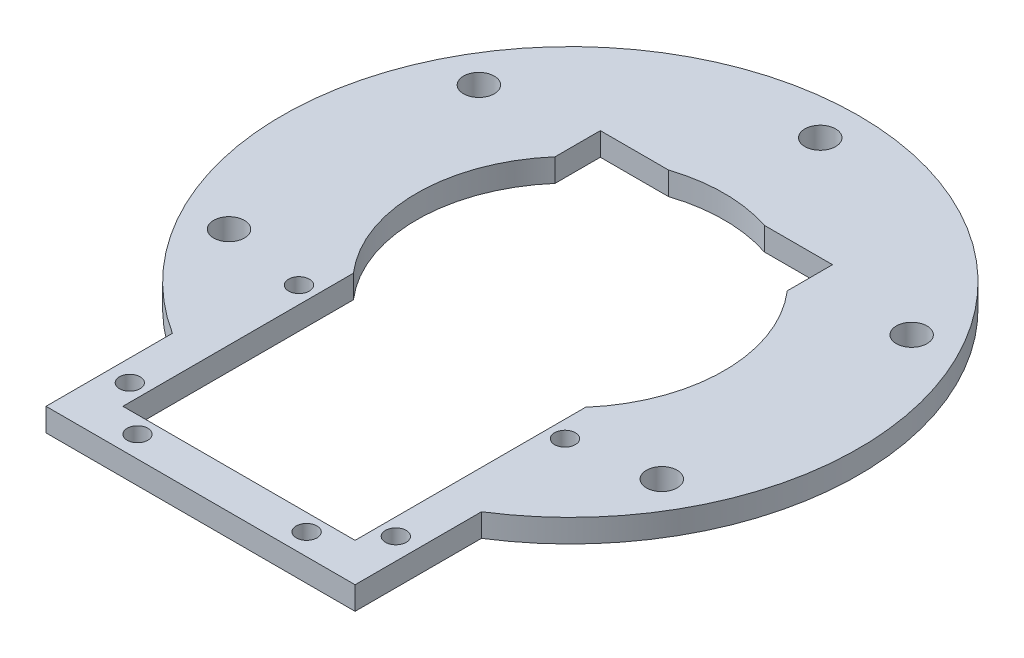
ISO-10303-21;
HEADER;
FILE_DESCRIPTION(('STEP AP214'),'2;1');
FILE_NAME('part.step','',(''),(''),'','','');
FILE_SCHEMA(('AUTOMOTIVE_DESIGN { 1 0 10303 214 1 1 1 1 }'));
ENDSEC;
DATA;
#1=APPLICATION_CONTEXT('core data for automotive mechanical design processes');
#2=APPLICATION_PROTOCOL_DEFINITION('international standard','automotive_design',2000,#1);
#3=PRODUCT_CONTEXT('',#1,'mechanical');
#4=PRODUCT('Part','Part','',(#3));
#5=PRODUCT_RELATED_PRODUCT_CATEGORY('part','',(#4));
#6=PRODUCT_DEFINITION_FORMATION('','',#4);
#7=PRODUCT_DEFINITION_CONTEXT('part definition',#1,'design');
#8=PRODUCT_DEFINITION('design','',#6,#7);
#9=PRODUCT_DEFINITION_SHAPE('','',#8);
#10=(LENGTH_UNIT() NAMED_UNIT(*) SI_UNIT(.MILLI.,.METRE.));
#11=(NAMED_UNIT(*) PLANE_ANGLE_UNIT() SI_UNIT($,.RADIAN.));
#12=(NAMED_UNIT(*) SI_UNIT($,.STERADIAN.) SOLID_ANGLE_UNIT());
#13=UNCERTAINTY_MEASURE_WITH_UNIT(LENGTH_MEASURE(1.E-05),#10,'distance_accuracy_value','');
#14=(GEOMETRIC_REPRESENTATION_CONTEXT(3) GLOBAL_UNCERTAINTY_ASSIGNED_CONTEXT((#13)) GLOBAL_UNIT_ASSIGNED_CONTEXT((#10,
#11,#12)) REPRESENTATION_CONTEXT('',''));
#15=CARTESIAN_POINT('',(0.,0.,0.));
#16=DIRECTION('',(0.,0.,1.));
#17=DIRECTION('',(1.,0.,0.));
#18=AXIS2_PLACEMENT_3D('',#15,#16,#17);
#19=CARTESIAN_POINT('',(15.1,0.,0.));
#20=DIRECTION('',(1.,0.,0.));
#21=DIRECTION('',(0.,0.,-1.));
#22=AXIS2_PLACEMENT_3D('',#19,#20,#21);
#23=PLANE('',#22);
#24=DIRECTION('',(0.,0.,-1.));
#25=VECTOR('',#24,1.);
#26=CARTESIAN_POINT('',(15.1,0.,0.));
#27=LINE('',#26,#25);
#28=CARTESIAN_POINT('',(15.1,0.,-13.1144957966366));
#29=VERTEX_POINT('',#28);
#30=CARTESIAN_POINT('',(15.1,0.,-19.));
#31=VERTEX_POINT('',#30);
#32=EDGE_CURVE('E296',#29,#31,#27,.T.);
#33=ORIENTED_EDGE('',*,*,#32,.F.);
#34=DIRECTION('',(0.,1.,0.));
#35=VECTOR('',#34,1.);
#36=CARTESIAN_POINT('',(15.1,0.,-13.1144957966366));
#37=LINE('',#36,#35);
#38=CARTESIAN_POINT('',(15.1,3.,-13.1144957966366));
#39=VERTEX_POINT('',#38);
#40=EDGE_CURVE('E158',#29,#39,#37,.T.);
#41=ORIENTED_EDGE('',*,*,#40,.T.);
#42=DIRECTION('',(0.,0.,-1.));
#43=VECTOR('',#42,1.);
#44=CARTESIAN_POINT('',(15.1,3.,0.));
#45=LINE('',#44,#43);
#46=CARTESIAN_POINT('',(15.1,3.,-19.));
#47=VERTEX_POINT('',#46);
#48=EDGE_CURVE('E169',#39,#47,#45,.T.);
#49=ORIENTED_EDGE('',*,*,#48,.T.);
#50=DIRECTION('',(0.,1.,0.));
#51=VECTOR('',#50,1.);
#52=CARTESIAN_POINT('',(15.1,0.,-19.));
#53=LINE('',#52,#51);
#54=EDGE_CURVE('E299',#31,#47,#53,.T.);
#55=ORIENTED_EDGE('',*,*,#54,.F.);
#56=EDGE_LOOP('',(#33,#41,#49,#55));
#57=FACE_BOUND('',#56,.T.);
#58=ADVANCED_FACE('F49',(#57),#23,.F.);
#59=CARTESIAN_POINT('',(-15.1,0.,0.));
#60=DIRECTION('',(-1.,0.,0.));
#61=DIRECTION('',(0.,0.,1.));
#62=AXIS2_PLACEMENT_3D('',#59,#60,#61);
#63=PLANE('',#62);
#64=DIRECTION('',(0.,0.,1.));
#65=VECTOR('',#64,1.);
#66=CARTESIAN_POINT('',(-15.1,0.,0.));
#67=LINE('',#66,#65);
#68=CARTESIAN_POINT('',(-15.1,0.,13.1144957966366));
#69=VERTEX_POINT('',#68);
#70=CARTESIAN_POINT('',(-15.1,0.,43.1));
#71=VERTEX_POINT('',#70);
#72=EDGE_CURVE('E340',#69,#71,#67,.T.);
#73=ORIENTED_EDGE('',*,*,#72,.F.);
#74=DIRECTION('',(0.,1.,0.));
#75=VECTOR('',#74,1.);
#76=CARTESIAN_POINT('',(-15.1,0.,13.1144957966366));
#77=LINE('',#76,#75);
#78=CARTESIAN_POINT('',(-15.1,3.,13.1144957966366));
#79=VERTEX_POINT('',#78);
#80=EDGE_CURVE('E159',#69,#79,#77,.T.);
#81=ORIENTED_EDGE('',*,*,#80,.T.);
#82=DIRECTION('',(0.,0.,1.));
#83=VECTOR('',#82,1.);
#84=CARTESIAN_POINT('',(-15.1,3.,0.));
#85=LINE('',#84,#83);
#86=CARTESIAN_POINT('',(-15.1,3.,43.1));
#87=VERTEX_POINT('',#86);
#88=EDGE_CURVE('E185',#79,#87,#85,.T.);
#89=ORIENTED_EDGE('',*,*,#88,.T.);
#90=DIRECTION('',(0.,1.,0.));
#91=VECTOR('',#90,1.);
#92=CARTESIAN_POINT('',(-15.1,0.,43.1));
#93=LINE('',#92,#91);
#94=EDGE_CURVE('E222',#71,#87,#93,.T.);
#95=ORIENTED_EDGE('',*,*,#94,.F.);
#96=EDGE_LOOP('',(#73,#81,#89,#95));
#97=FACE_BOUND('',#96,.T.);
#98=ADVANCED_FACE('F384',(#97),#63,.F.);
#99=CARTESIAN_POINT('',(0.,0.,-19.));
#100=DIRECTION('',(0.,0.,-1.));
#101=DIRECTION('',(-1.,0.,0.));
#102=AXIS2_PLACEMENT_3D('',#99,#100,#101);
#103=PLANE('',#102);
#104=DIRECTION('',(-1.,0.,0.));
#105=VECTOR('',#104,1.);
#106=CARTESIAN_POINT('',(0.,0.,-19.));
#107=LINE('',#106,#105);
#108=CARTESIAN_POINT('',(-6.24499799839839,0.,-19.));
#109=VERTEX_POINT('',#108);
#110=CARTESIAN_POINT('',(-15.1,0.,-19.));
#111=VERTEX_POINT('',#110);
#112=EDGE_CURVE('E300',#109,#111,#107,.T.);
#113=ORIENTED_EDGE('',*,*,#112,.F.);
#114=DIRECTION('',(0.,1.,0.));
#115=VECTOR('',#114,1.);
#116=CARTESIAN_POINT('',(-6.24499799839839,0.,-19.));
#117=LINE('',#116,#115);
#118=CARTESIAN_POINT('',(-6.24499799839839,3.,-19.));
#119=VERTEX_POINT('',#118);
#120=EDGE_CURVE('E11',#109,#119,#117,.T.);
#121=ORIENTED_EDGE('',*,*,#120,.T.);
#122=DIRECTION('',(-1.,0.,0.));
#123=VECTOR('',#122,1.);
#124=CARTESIAN_POINT('',(0.,3.,-19.));
#125=LINE('',#124,#123);
#126=CARTESIAN_POINT('',(-15.1,3.,-19.));
#127=VERTEX_POINT('',#126);
#128=EDGE_CURVE('E314',#119,#127,#125,.T.);
#129=ORIENTED_EDGE('',*,*,#128,.T.);
#130=DIRECTION('',(0.,1.,0.));
#131=VECTOR('',#130,1.);
#132=CARTESIAN_POINT('',(-15.1,0.,-19.));
#133=LINE('',#132,#131);
#134=EDGE_CURVE('E306',#111,#127,#133,.T.);
#135=ORIENTED_EDGE('',*,*,#134,.F.);
#136=EDGE_LOOP('',(#113,#121,#129,#135));
#137=FACE_BOUND('',#136,.T.);
#138=ADVANCED_FACE('F377',(#137),#103,.F.);
#139=CARTESIAN_POINT('',(0.,3.,0.));
#140=DIRECTION('',(0.,1.,0.));
#141=DIRECTION('',(0.,0.,1.));
#142=AXIS2_PLACEMENT_3D('',#139,#140,#141);
#143=PLANE('',#142);
#144=CARTESIAN_POINT('',(0.,3.,0.));
#145=DIRECTION('',(0.,1.,0.));
#146=DIRECTION('',(0.,0.,1.));
#147=AXIS2_PLACEMENT_3D('',#144,#145,#146);
#148=CIRCLE('',#147,20.);
#149=CARTESIAN_POINT('',(15.1,3.,13.1144957966366));
#150=VERTEX_POINT('',#149);
#151=EDGE_CURVE('E151',#150,#39,#148,.T.);
#152=ORIENTED_EDGE('',*,*,#151,.F.);
#153=CARTESIAN_POINT('',(15.1,3.,43.1));
#154=VERTEX_POINT('',#153);
#155=EDGE_CURVE('E167',#154,#150,#45,.T.);
#156=ORIENTED_EDGE('',*,*,#155,.F.);
#157=DIRECTION('',(1.,0.,0.));
#158=VECTOR('',#157,1.);
#159=CARTESIAN_POINT('',(0.,3.,43.1));
#160=LINE('',#159,#158);
#161=EDGE_CURVE('E179',#87,#154,#160,.T.);
#162=ORIENTED_EDGE('',*,*,#161,.F.);
#163=ORIENTED_EDGE('',*,*,#88,.F.);
#164=CARTESIAN_POINT('',(-15.1,3.,-13.1144957966366));
#165=VERTEX_POINT('',#164);
#166=EDGE_CURVE('E173',#165,#79,#148,.T.);
#167=ORIENTED_EDGE('',*,*,#166,.F.);
#168=EDGE_CURVE('E191',#127,#165,#85,.T.);
#169=ORIENTED_EDGE('',*,*,#168,.F.);
#170=ORIENTED_EDGE('',*,*,#128,.F.);
#171=CARTESIAN_POINT('',(6.24499799839839,3.,-19.));
#172=VERTEX_POINT('',#171);
#173=EDGE_CURVE('E171',#172,#119,#148,.T.);
#174=ORIENTED_EDGE('',*,*,#173,.F.);
#175=EDGE_CURVE('E286',#47,#172,#125,.T.);
#176=ORIENTED_EDGE('',*,*,#175,.F.);
#177=ORIENTED_EDGE('',*,*,#48,.F.);
#178=EDGE_LOOP('',(#152,#156,#162,#163,#167,#169,#170,#174,#176,#177));
#179=FACE_BOUND('',#178,.T.);
#180=CARTESIAN_POINT('',(17.3,3.,18.));
#181=DIRECTION('',(0.,1.,0.));
#182=DIRECTION('',(0.,0.,1.));
#183=AXIS2_PLACEMENT_3D('',#180,#181,#182);
#184=CIRCLE('',#183,1.35);
#185=CARTESIAN_POINT('',(17.3,3.,19.35));
#186=VERTEX_POINT('',#185);
#187=EDGE_CURVE('E535',#186,#186,#184,.T.);
#188=ORIENTED_EDGE('',*,*,#187,.F.);
#189=EDGE_LOOP('',(#188));
#190=FACE_BOUND('',#189,.T.);
#191=CARTESIAN_POINT('',(-17.3,3.,18.));
#192=DIRECTION('',(0.,1.,0.));
#193=DIRECTION('',(0.,0.,1.));
#194=AXIS2_PLACEMENT_3D('',#191,#192,#193);
#195=CIRCLE('',#194,1.35000000000001);
#196=CARTESIAN_POINT('',(-17.3,3.,19.35));
#197=VERTEX_POINT('',#196);
#198=EDGE_CURVE('E528',#197,#197,#195,.T.);
#199=ORIENTED_EDGE('',*,*,#198,.F.);
#200=EDGE_LOOP('',(#199));
#201=FACE_BOUND('',#200,.T.);
#202=DIRECTION('',(0.,0.,-1.));
#203=VECTOR('',#202,1.);
#204=CARTESIAN_POINT('',(20.1,3.,0.));
#205=LINE('',#204,#203);
#206=CARTESIAN_POINT('',(20.1,3.,48.1));
#207=VERTEX_POINT('',#206);
#208=CARTESIAN_POINT('',(20.1,3.,31.658174299855));
#209=VERTEX_POINT('',#208);
#210=EDGE_CURVE('E203',#207,#209,#205,.T.);
#211=ORIENTED_EDGE('',*,*,#210,.T.);
#212=CARTESIAN_POINT('',(0.,3.,0.));
#213=DIRECTION('',(0.,1.,0.));
#214=DIRECTION('',(0.,0.,1.));
#215=AXIS2_PLACEMENT_3D('',#212,#213,#214);
#216=CIRCLE('',#215,37.5);
#217=CARTESIAN_POINT('',(-20.1,3.,31.658174299855));
#218=VERTEX_POINT('',#217);
#219=EDGE_CURVE('E269',#209,#218,#216,.T.);
#220=ORIENTED_EDGE('',*,*,#219,.T.);
#221=DIRECTION('',(0.,0.,1.));
#222=VECTOR('',#221,1.);
#223=CARTESIAN_POINT('',(-20.1,3.,0.));
#224=LINE('',#223,#222);
#225=CARTESIAN_POINT('',(-20.1,3.,48.1));
#226=VERTEX_POINT('',#225);
#227=EDGE_CURVE('E195',#218,#226,#224,.T.);
#228=ORIENTED_EDGE('',*,*,#227,.T.);
#229=DIRECTION('',(1.,0.,0.));
#230=VECTOR('',#229,1.);
#231=CARTESIAN_POINT('',(0.,3.,48.1));
#232=LINE('',#231,#230);
#233=EDGE_CURVE('E199',#226,#207,#232,.T.);
#234=ORIENTED_EDGE('',*,*,#233,.T.);
#235=EDGE_LOOP('',(#211,#220,#228,#234));
#236=FACE_BOUND('',#235,.T.);
#237=CARTESIAN_POINT('',(-28.1458256229942,3.,16.25));
#238=DIRECTION('',(0.,1.,0.));
#239=DIRECTION('',(0.,0.,1.));
#240=AXIS2_PLACEMENT_3D('',#237,#238,#239);
#241=CIRCLE('',#240,2.00000000000031);
#242=CARTESIAN_POINT('',(-28.1458256229942,3.,18.2500000000003));
#243=VERTEX_POINT('',#242);
#244=EDGE_CURVE('E237',#243,#243,#241,.T.);
#245=ORIENTED_EDGE('',*,*,#244,.F.);
#246=EDGE_LOOP('',(#245));
#247=FACE_BOUND('',#246,.T.);
#248=CARTESIAN_POINT('',(28.1458256229943,3.,16.25));
#249=DIRECTION('',(0.,1.,0.));
#250=DIRECTION('',(0.,0.,1.));
#251=AXIS2_PLACEMENT_3D('',#248,#249,#250);
#252=CIRCLE('',#251,2.00000000000015);
#253=CARTESIAN_POINT('',(28.1458256229943,3.,18.2500000000001));
#254=VERTEX_POINT('',#253);
#255=EDGE_CURVE('E245',#254,#254,#252,.T.);
#256=ORIENTED_EDGE('',*,*,#255,.F.);
#257=EDGE_LOOP('',(#256));
#258=FACE_BOUND('',#257,.T.);
#259=CARTESIAN_POINT('',(0.,3.,-32.5));
#260=DIRECTION('',(0.,1.,0.));
#261=DIRECTION('',(0.,0.,1.));
#262=AXIS2_PLACEMENT_3D('',#259,#260,#261);
#263=CIRCLE('',#262,2.);
#264=CARTESIAN_POINT('',(0.,3.,-30.5));
#265=VERTEX_POINT('',#264);
#266=EDGE_CURVE('E261',#265,#265,#263,.T.);
#267=ORIENTED_EDGE('',*,*,#266,.F.);
#268=EDGE_LOOP('',(#267));
#269=FACE_BOUND('',#268,.T.);
#270=CARTESIAN_POINT('',(28.1458256229942,3.,-16.25));
#271=DIRECTION('',(0.,1.,0.));
#272=DIRECTION('',(0.,0.,1.));
#273=AXIS2_PLACEMENT_3D('',#270,#271,#272);
#274=CIRCLE('',#273,2.00000000000008);
#275=CARTESIAN_POINT('',(28.1458256229942,3.,-14.2499999999999));
#276=VERTEX_POINT('',#275);
#277=EDGE_CURVE('E253',#276,#276,#274,.T.);
#278=ORIENTED_EDGE('',*,*,#277,.F.);
#279=EDGE_LOOP('',(#278));
#280=FACE_BOUND('',#279,.T.);
#281=CARTESIAN_POINT('',(-28.1458256229943,3.,-16.25));
#282=DIRECTION('',(0.,1.,0.));
#283=DIRECTION('',(0.,0.,1.));
#284=AXIS2_PLACEMENT_3D('',#281,#282,#283);
#285=CIRCLE('',#284,2.00000000000039);
#286=CARTESIAN_POINT('',(-28.1458256229943,3.,-14.2499999999996));
#287=VERTEX_POINT('',#286);
#288=EDGE_CURVE('E229',#287,#287,#285,.T.);
#289=ORIENTED_EDGE('',*,*,#288,.F.);
#290=EDGE_LOOP('',(#289));
#291=FACE_BOUND('',#290,.T.);
#292=CARTESIAN_POINT('',(11.,3.,45.3));
#293=DIRECTION('',(0.,1.,0.));
#294=DIRECTION('',(0.,0.,1.));
#295=AXIS2_PLACEMENT_3D('',#292,#293,#294);
#296=CIRCLE('',#295,1.35000000000001);
#297=CARTESIAN_POINT('',(11.,3.,46.65));
#298=VERTEX_POINT('',#297);
#299=EDGE_CURVE('E317',#298,#298,#296,.T.);
#300=ORIENTED_EDGE('',*,*,#299,.F.);
#301=EDGE_LOOP('',(#300));
#302=FACE_BOUND('',#301,.T.);
#303=CARTESIAN_POINT('',(-11.,3.,45.3));
#304=DIRECTION('',(0.,1.,0.));
#305=DIRECTION('',(0.,0.,1.));
#306=AXIS2_PLACEMENT_3D('',#303,#304,#305);
#307=CIRCLE('',#306,1.34999999999999);
#308=CARTESIAN_POINT('',(-11.,3.,46.65));
#309=VERTEX_POINT('',#308);
#310=EDGE_CURVE('E358',#309,#309,#307,.T.);
#311=ORIENTED_EDGE('',*,*,#310,.F.);
#312=EDGE_LOOP('',(#311));
#313=FACE_BOUND('',#312,.T.);
#314=CARTESIAN_POINT('',(-17.3,3.,40.));
#315=DIRECTION('',(0.,1.,0.));
#316=DIRECTION('',(0.,0.,1.));
#317=AXIS2_PLACEMENT_3D('',#314,#315,#316);
#318=CIRCLE('',#317,1.35000000000001);
#319=CARTESIAN_POINT('',(-17.3,3.,41.35));
#320=VERTEX_POINT('',#319);
#321=EDGE_CURVE('E361',#320,#320,#318,.T.);
#322=ORIENTED_EDGE('',*,*,#321,.F.);
#323=EDGE_LOOP('',(#322));
#324=FACE_BOUND('',#323,.T.);
#325=CARTESIAN_POINT('',(17.3,3.,40.));
#326=DIRECTION('',(0.,1.,0.));
#327=DIRECTION('',(0.,0.,1.));
#328=AXIS2_PLACEMENT_3D('',#325,#326,#327);
#329=CIRCLE('',#328,1.35000000000001);
#330=CARTESIAN_POINT('',(17.3,3.,41.35));
#331=VERTEX_POINT('',#330);
#332=EDGE_CURVE('E187',#331,#331,#329,.T.);
#333=ORIENTED_EDGE('',*,*,#332,.F.);
#334=EDGE_LOOP('',(#333));
#335=FACE_BOUND('',#334,.T.);
#336=ADVANCED_FACE('F164',(#179,#190,#201,#236,#247,#258,#269,#280,#291,#302,#313,#324,#335),
#143,.T.);
#337=CARTESIAN_POINT('',(0.,0.,0.));
#338=DIRECTION('',(0.,1.,0.));
#339=DIRECTION('',(0.,0.,1.));
#340=AXIS2_PLACEMENT_3D('',#337,#338,#339);
#341=PLANE('',#340);
#342=CARTESIAN_POINT('',(17.3,0.,18.));
#343=DIRECTION('',(0.,1.,0.));
#344=DIRECTION('',(0.,0.,1.));
#345=AXIS2_PLACEMENT_3D('',#342,#343,#344);
#346=CIRCLE('',#345,1.35);
#347=CARTESIAN_POINT('',(17.3,0.,19.35));
#348=VERTEX_POINT('',#347);
#349=EDGE_CURVE('E310',#348,#348,#346,.T.);
#350=ORIENTED_EDGE('',*,*,#349,.T.);
#351=EDGE_LOOP('',(#350));
#352=FACE_BOUND('',#351,.T.);
#353=CARTESIAN_POINT('',(-17.3,0.,18.));
#354=DIRECTION('',(0.,1.,0.));
#355=DIRECTION('',(0.,0.,1.));
#356=AXIS2_PLACEMENT_3D('',#353,#354,#355);
#357=CIRCLE('',#356,1.35000000000001);
#358=CARTESIAN_POINT('',(-17.3,0.,19.35));
#359=VERTEX_POINT('',#358);
#360=EDGE_CURVE('E532',#359,#359,#357,.T.);
#361=ORIENTED_EDGE('',*,*,#360,.T.);
#362=EDGE_LOOP('',(#361));
#363=FACE_BOUND('',#362,.T.);
#364=CARTESIAN_POINT('',(15.1,0.,43.1));
#365=VERTEX_POINT('',#364);
#366=CARTESIAN_POINT('',(15.1,0.,13.1144957966366));
#367=VERTEX_POINT('',#366);
#368=EDGE_CURVE('E334',#365,#367,#27,.T.);
#369=ORIENTED_EDGE('',*,*,#368,.T.);
#370=CARTESIAN_POINT('',(0.,0.,0.));
#371=DIRECTION('',(0.,1.,0.));
#372=DIRECTION('',(0.,0.,1.));
#373=AXIS2_PLACEMENT_3D('',#370,#371,#372);
#374=CIRCLE('',#373,20.);
#375=EDGE_CURVE('E65',#367,#29,#374,.T.);
#376=ORIENTED_EDGE('',*,*,#375,.T.);
#377=ORIENTED_EDGE('',*,*,#32,.T.);
#378=CARTESIAN_POINT('',(6.24499799839839,0.,-19.));
#379=VERTEX_POINT('',#378);
#380=EDGE_CURVE('E285',#31,#379,#107,.T.);
#381=ORIENTED_EDGE('',*,*,#380,.T.);
#382=EDGE_CURVE('E293',#379,#109,#374,.T.);
#383=ORIENTED_EDGE('',*,*,#382,.T.);
#384=ORIENTED_EDGE('',*,*,#112,.T.);
#385=CARTESIAN_POINT('',(-15.1,0.,-13.1144957966366));
#386=VERTEX_POINT('',#385);
#387=EDGE_CURVE('E341',#111,#386,#67,.T.);
#388=ORIENTED_EDGE('',*,*,#387,.T.);
#389=EDGE_CURVE('E73',#386,#69,#374,.T.);
#390=ORIENTED_EDGE('',*,*,#389,.T.);
#391=ORIENTED_EDGE('',*,*,#72,.T.);
#392=DIRECTION('',(1.,0.,0.));
#393=VECTOR('',#392,1.);
#394=CARTESIAN_POINT('',(0.,0.,43.1));
#395=LINE('',#394,#393);
#396=EDGE_CURVE('E337',#71,#365,#395,.T.);
#397=ORIENTED_EDGE('',*,*,#396,.T.);
#398=EDGE_LOOP('',(#369,#376,#377,#381,#383,#384,#388,#390,#391,#397));
#399=FACE_BOUND('',#398,.T.);
#400=CARTESIAN_POINT('',(0.,0.,0.));
#401=DIRECTION('',(0.,1.,0.));
#402=DIRECTION('',(0.,0.,1.));
#403=AXIS2_PLACEMENT_3D('',#400,#401,#402);
#404=CIRCLE('',#403,37.5);
#405=CARTESIAN_POINT('',(20.1,0.,31.658174299855));
#406=VERTEX_POINT('',#405);
#407=CARTESIAN_POINT('',(-20.1,0.,31.658174299855));
#408=VERTEX_POINT('',#407);
#409=EDGE_CURVE('E265',#406,#408,#404,.T.);
#410=ORIENTED_EDGE('',*,*,#409,.F.);
#411=DIRECTION('',(0.,0.,-1.));
#412=VECTOR('',#411,1.);
#413=CARTESIAN_POINT('',(20.1,0.,0.));
#414=LINE('',#413,#412);
#415=CARTESIAN_POINT('',(20.1,0.,48.1));
#416=VERTEX_POINT('',#415);
#417=EDGE_CURVE('E228',#416,#406,#414,.T.);
#418=ORIENTED_EDGE('',*,*,#417,.F.);
#419=DIRECTION('',(1.,0.,0.));
#420=VECTOR('',#419,1.);
#421=CARTESIAN_POINT('',(0.,0.,48.1));
#422=LINE('',#421,#420);
#423=CARTESIAN_POINT('',(-20.1,0.,48.1));
#424=VERTEX_POINT('',#423);
#425=EDGE_CURVE('E349',#424,#416,#422,.T.);
#426=ORIENTED_EDGE('',*,*,#425,.F.);
#427=DIRECTION('',(0.,0.,1.));
#428=VECTOR('',#427,1.);
#429=CARTESIAN_POINT('',(-20.1,0.,0.));
#430=LINE('',#429,#428);
#431=EDGE_CURVE('E345',#408,#424,#430,.T.);
#432=ORIENTED_EDGE('',*,*,#431,.F.);
#433=EDGE_LOOP('',(#410,#418,#426,#432));
#434=FACE_BOUND('',#433,.T.);
#435=CARTESIAN_POINT('',(0.,0.,-32.5));
#436=DIRECTION('',(0.,1.,0.));
#437=DIRECTION('',(0.,0.,1.));
#438=AXIS2_PLACEMENT_3D('',#435,#436,#437);
#439=CIRCLE('',#438,2.);
#440=CARTESIAN_POINT('',(0.,0.,-30.5));
#441=VERTEX_POINT('',#440);
#442=EDGE_CURVE('E257',#441,#441,#439,.T.);
#443=ORIENTED_EDGE('',*,*,#442,.T.);
#444=EDGE_LOOP('',(#443));
#445=FACE_BOUND('',#444,.T.);
#446=CARTESIAN_POINT('',(28.1458256229942,0.,-16.25));
#447=DIRECTION('',(0.,1.,0.));
#448=DIRECTION('',(0.,0.,1.));
#449=AXIS2_PLACEMENT_3D('',#446,#447,#448);
#450=CIRCLE('',#449,2.00000000000008);
#451=CARTESIAN_POINT('',(28.1458256229942,0.,-14.2499999999999));
#452=VERTEX_POINT('',#451);
#453=EDGE_CURVE('E249',#452,#452,#450,.T.);
#454=ORIENTED_EDGE('',*,*,#453,.T.);
#455=EDGE_LOOP('',(#454));
#456=FACE_BOUND('',#455,.T.);
#457=CARTESIAN_POINT('',(28.1458256229943,0.,16.25));
#458=DIRECTION('',(0.,1.,0.));
#459=DIRECTION('',(0.,0.,1.));
#460=AXIS2_PLACEMENT_3D('',#457,#458,#459);
#461=CIRCLE('',#460,2.00000000000015);
#462=CARTESIAN_POINT('',(28.1458256229943,0.,18.2500000000001));
#463=VERTEX_POINT('',#462);
#464=EDGE_CURVE('E241',#463,#463,#461,.T.);
#465=ORIENTED_EDGE('',*,*,#464,.T.);
#466=EDGE_LOOP('',(#465));
#467=FACE_BOUND('',#466,.T.);
#468=CARTESIAN_POINT('',(-28.1458256229942,0.,16.25));
#469=DIRECTION('',(0.,1.,0.));
#470=DIRECTION('',(0.,0.,1.));
#471=AXIS2_PLACEMENT_3D('',#468,#469,#470);
#472=CIRCLE('',#471,2.00000000000031);
#473=CARTESIAN_POINT('',(-28.1458256229942,0.,18.2500000000003));
#474=VERTEX_POINT('',#473);
#475=EDGE_CURVE('E233',#474,#474,#472,.T.);
#476=ORIENTED_EDGE('',*,*,#475,.T.);
#477=EDGE_LOOP('',(#476));
#478=FACE_BOUND('',#477,.T.);
#479=CARTESIAN_POINT('',(-28.1458256229943,0.,-16.25));
#480=DIRECTION('',(0.,1.,0.));
#481=DIRECTION('',(0.,0.,1.));
#482=AXIS2_PLACEMENT_3D('',#479,#480,#481);
#483=CIRCLE('',#482,2.00000000000039);
#484=CARTESIAN_POINT('',(-28.1458256229943,0.,-14.2499999999996));
#485=VERTEX_POINT('',#484);
#486=EDGE_CURVE('E211',#485,#485,#483,.T.);
#487=ORIENTED_EDGE('',*,*,#486,.T.);
#488=EDGE_LOOP('',(#487));
#489=FACE_BOUND('',#488,.T.);
#490=CARTESIAN_POINT('',(11.,0.,45.3));
#491=DIRECTION('',(0.,1.,0.));
#492=DIRECTION('',(0.,0.,1.));
#493=AXIS2_PLACEMENT_3D('',#490,#491,#492);
#494=CIRCLE('',#493,1.35000000000001);
#495=CARTESIAN_POINT('',(11.,0.,46.65));
#496=VERTEX_POINT('',#495);
#497=EDGE_CURVE('E206',#496,#496,#494,.T.);
#498=ORIENTED_EDGE('',*,*,#497,.T.);
#499=EDGE_LOOP('',(#498));
#500=FACE_BOUND('',#499,.T.);
#501=CARTESIAN_POINT('',(-11.,0.,45.3));
#502=DIRECTION('',(0.,1.,0.));
#503=DIRECTION('',(0.,0.,1.));
#504=AXIS2_PLACEMENT_3D('',#501,#502,#503);
#505=CIRCLE('',#504,1.34999999999999);
#506=CARTESIAN_POINT('',(-11.,0.,46.65));
#507=VERTEX_POINT('',#506);
#508=EDGE_CURVE('E322',#507,#507,#505,.T.);
#509=ORIENTED_EDGE('',*,*,#508,.T.);
#510=EDGE_LOOP('',(#509));
#511=FACE_BOUND('',#510,.T.);
#512=CARTESIAN_POINT('',(-17.3,0.,40.));
#513=DIRECTION('',(0.,1.,0.));
#514=DIRECTION('',(0.,0.,1.));
#515=AXIS2_PLACEMENT_3D('',#512,#513,#514);
#516=CIRCLE('',#515,1.35000000000001);
#517=CARTESIAN_POINT('',(-17.3,0.,41.35));
#518=VERTEX_POINT('',#517);
#519=EDGE_CURVE('E326',#518,#518,#516,.T.);
#520=ORIENTED_EDGE('',*,*,#519,.T.);
#521=EDGE_LOOP('',(#520));
#522=FACE_BOUND('',#521,.T.);
#523=CARTESIAN_POINT('',(17.3,0.,40.));
#524=DIRECTION('',(0.,1.,0.));
#525=DIRECTION('',(0.,0.,1.));
#526=AXIS2_PLACEMENT_3D('',#523,#524,#525);
#527=CIRCLE('',#526,1.35000000000001);
#528=CARTESIAN_POINT('',(17.3,0.,41.35));
#529=VERTEX_POINT('',#528);
#530=EDGE_CURVE('E330',#529,#529,#527,.T.);
#531=ORIENTED_EDGE('',*,*,#530,.T.);
#532=EDGE_LOOP('',(#531));
#533=FACE_BOUND('',#532,.T.);
#534=ADVANCED_FACE('F291',(#352,#363,#399,#434,#445,#456,#467,#478,#489,#500,#511,#522,#533),
#341,.F.);
#535=CARTESIAN_POINT('',(0.,3.,0.));
#536=DIRECTION('',(0.,-1.,0.));
#537=DIRECTION('',(0.,0.,-1.));
#538=AXIS2_PLACEMENT_3D('',#535,#536,#537);
#539=CYLINDRICAL_SURFACE('',#538,37.5);
#540=ORIENTED_EDGE('',*,*,#219,.F.);
#541=DIRECTION('',(0.,1.,0.));
#542=VECTOR('',#541,1.);
#543=CARTESIAN_POINT('',(20.1,0.,31.658174299855));
#544=LINE('',#543,#542);
#545=EDGE_CURVE('E207',#406,#209,#544,.T.);
#546=ORIENTED_EDGE('',*,*,#545,.F.);
#547=ORIENTED_EDGE('',*,*,#409,.T.);
#548=DIRECTION('',(0.,1.,0.));
#549=VECTOR('',#548,1.);
#550=CARTESIAN_POINT('',(-20.1,0.,31.658174299855));
#551=LINE('',#550,#549);
#552=EDGE_CURVE('E218',#408,#218,#551,.T.);
#553=ORIENTED_EDGE('',*,*,#552,.T.);
#554=EDGE_LOOP('',(#540,#546,#547,#553));
#555=FACE_BOUND('',#554,.T.);
#556=ADVANCED_FACE('F51',(#555),#539,.T.);
#557=CARTESIAN_POINT('',(0.,3.,-32.5));
#558=DIRECTION('',(0.,-1.,0.));
#559=DIRECTION('',(0.,0.,-1.));
#560=AXIS2_PLACEMENT_3D('',#557,#558,#559);
#561=CYLINDRICAL_SURFACE('',#560,2.);
#562=ORIENTED_EDGE('',*,*,#266,.T.);
#563=EDGE_LOOP('',(#562));
#564=FACE_BOUND('',#563,.T.);
#565=ORIENTED_EDGE('',*,*,#442,.F.);
#566=EDGE_LOOP('',(#565));
#567=FACE_BOUND('',#566,.T.);
#568=ADVANCED_FACE('F428',(#564,#567),#561,.F.);
#569=CARTESIAN_POINT('',(28.1458256229942,3.,-16.25));
#570=DIRECTION('',(0.,-1.,0.));
#571=DIRECTION('',(0.,0.,-1.));
#572=AXIS2_PLACEMENT_3D('',#569,#570,#571);
#573=CYLINDRICAL_SURFACE('',#572,2.00000000000008);
#574=ORIENTED_EDGE('',*,*,#277,.T.);
#575=EDGE_LOOP('',(#574));
#576=FACE_BOUND('',#575,.T.);
#577=ORIENTED_EDGE('',*,*,#453,.F.);
#578=EDGE_LOOP('',(#577));
#579=FACE_BOUND('',#578,.T.);
#580=ADVANCED_FACE('F425',(#576,#579),#573,.F.);
#581=CARTESIAN_POINT('',(28.1458256229943,3.,16.25));
#582=DIRECTION('',(0.,-1.,0.));
#583=DIRECTION('',(0.,0.,-1.));
#584=AXIS2_PLACEMENT_3D('',#581,#582,#583);
#585=CYLINDRICAL_SURFACE('',#584,2.00000000000015);
#586=ORIENTED_EDGE('',*,*,#255,.T.);
#587=EDGE_LOOP('',(#586));
#588=FACE_BOUND('',#587,.T.);
#589=ORIENTED_EDGE('',*,*,#464,.F.);
#590=EDGE_LOOP('',(#589));
#591=FACE_BOUND('',#590,.T.);
#592=ADVANCED_FACE('F415',(#588,#591),#585,.F.);
#593=CARTESIAN_POINT('',(-28.1458256229942,3.,16.25));
#594=DIRECTION('',(0.,-1.,0.));
#595=DIRECTION('',(0.,0.,-1.));
#596=AXIS2_PLACEMENT_3D('',#593,#594,#595);
#597=CYLINDRICAL_SURFACE('',#596,2.00000000000031);
#598=ORIENTED_EDGE('',*,*,#244,.T.);
#599=EDGE_LOOP('',(#598));
#600=FACE_BOUND('',#599,.T.);
#601=ORIENTED_EDGE('',*,*,#475,.F.);
#602=EDGE_LOOP('',(#601));
#603=FACE_BOUND('',#602,.T.);
#604=ADVANCED_FACE('F409',(#600,#603),#597,.F.);
#605=CARTESIAN_POINT('',(-28.1458256229943,3.,-16.25));
#606=DIRECTION('',(0.,-1.,0.));
#607=DIRECTION('',(0.,0.,-1.));
#608=AXIS2_PLACEMENT_3D('',#605,#606,#607);
#609=CYLINDRICAL_SURFACE('',#608,2.00000000000039);
#610=ORIENTED_EDGE('',*,*,#288,.T.);
#611=EDGE_LOOP('',(#610));
#612=FACE_BOUND('',#611,.T.);
#613=ORIENTED_EDGE('',*,*,#486,.F.);
#614=EDGE_LOOP('',(#613));
#615=FACE_BOUND('',#614,.T.);
#616=ADVANCED_FACE('F401',(#612,#615),#609,.F.);
#617=ORIENTED_EDGE('',*,*,#155,.T.);
#618=DIRECTION('',(0.,1.,0.));
#619=VECTOR('',#618,1.);
#620=CARTESIAN_POINT('',(15.1,0.,13.1144957966366));
#621=LINE('',#620,#619);
#622=EDGE_CURVE('E148',#150,#367,#621,.F.);
#623=ORIENTED_EDGE('',*,*,#622,.T.);
#624=ORIENTED_EDGE('',*,*,#368,.F.);
#625=DIRECTION('',(0.,1.,0.));
#626=VECTOR('',#625,1.);
#627=CARTESIAN_POINT('',(15.1,0.,43.1));
#628=LINE('',#627,#626);
#629=EDGE_CURVE('E177',#365,#154,#628,.T.);
#630=ORIENTED_EDGE('',*,*,#629,.T.);
#631=EDGE_LOOP('',(#617,#623,#624,#630));
#632=FACE_BOUND('',#631,.T.);
#633=ADVANCED_FACE('F175',(#632),#23,.F.);
#634=CARTESIAN_POINT('',(20.1,0.,0.));
#635=DIRECTION('',(1.,0.,0.));
#636=DIRECTION('',(0.,0.,-1.));
#637=AXIS2_PLACEMENT_3D('',#634,#635,#636);
#638=PLANE('',#637);
#639=ORIENTED_EDGE('',*,*,#210,.F.);
#640=DIRECTION('',(0.,1.,0.));
#641=VECTOR('',#640,1.);
#642=CARTESIAN_POINT('',(20.1,0.,48.1));
#643=LINE('',#642,#641);
#644=EDGE_CURVE('E212',#416,#207,#643,.T.);
#645=ORIENTED_EDGE('',*,*,#644,.F.);
#646=ORIENTED_EDGE('',*,*,#417,.T.);
#647=ORIENTED_EDGE('',*,*,#545,.T.);
#648=EDGE_LOOP('',(#639,#645,#646,#647));
#649=FACE_BOUND('',#648,.T.);
#650=ADVANCED_FACE('F400',(#649),#638,.T.);
#651=CARTESIAN_POINT('',(0.,0.,48.1));
#652=DIRECTION('',(0.,0.,1.));
#653=DIRECTION('',(1.,0.,0.));
#654=AXIS2_PLACEMENT_3D('',#651,#652,#653);
#655=PLANE('',#654);
#656=ORIENTED_EDGE('',*,*,#233,.F.);
#657=DIRECTION('',(0.,1.,0.));
#658=VECTOR('',#657,1.);
#659=CARTESIAN_POINT('',(-20.1,0.,48.1));
#660=LINE('',#659,#658);
#661=EDGE_CURVE('E215',#424,#226,#660,.T.);
#662=ORIENTED_EDGE('',*,*,#661,.F.);
#663=ORIENTED_EDGE('',*,*,#425,.T.);
#664=ORIENTED_EDGE('',*,*,#644,.T.);
#665=EDGE_LOOP('',(#656,#662,#663,#664));
#666=FACE_BOUND('',#665,.T.);
#667=ADVANCED_FACE('F406',(#666),#655,.T.);
#668=CARTESIAN_POINT('',(-20.1,0.,0.));
#669=DIRECTION('',(-1.,0.,0.));
#670=DIRECTION('',(0.,0.,1.));
#671=AXIS2_PLACEMENT_3D('',#668,#669,#670);
#672=PLANE('',#671);
#673=ORIENTED_EDGE('',*,*,#227,.F.);
#674=ORIENTED_EDGE('',*,*,#552,.F.);
#675=ORIENTED_EDGE('',*,*,#431,.T.);
#676=ORIENTED_EDGE('',*,*,#661,.T.);
#677=EDGE_LOOP('',(#673,#674,#675,#676));
#678=FACE_BOUND('',#677,.T.);
#679=ADVANCED_FACE('F466',(#678),#672,.T.);
#680=ORIENTED_EDGE('',*,*,#168,.T.);
#681=DIRECTION('',(0.,1.,0.));
#682=VECTOR('',#681,1.);
#683=CARTESIAN_POINT('',(-15.1,0.,-13.1144957966366));
#684=LINE('',#683,#682);
#685=EDGE_CURVE('E519',#165,#386,#684,.F.);
#686=ORIENTED_EDGE('',*,*,#685,.T.);
#687=ORIENTED_EDGE('',*,*,#387,.F.);
#688=ORIENTED_EDGE('',*,*,#134,.T.);
#689=EDGE_LOOP('',(#680,#686,#687,#688));
#690=FACE_BOUND('',#689,.T.);
#691=ADVANCED_FACE('F396',(#690),#63,.F.);
#692=CARTESIAN_POINT('',(17.3,0.,40.));
#693=DIRECTION('',(0.,1.,0.));
#694=DIRECTION('',(0.,0.,1.));
#695=AXIS2_PLACEMENT_3D('',#692,#693,#694);
#696=CYLINDRICAL_SURFACE('',#695,1.35000000000001);
#697=ORIENTED_EDGE('',*,*,#530,.F.);
#698=EDGE_LOOP('',(#697));
#699=FACE_BOUND('',#698,.T.);
#700=ORIENTED_EDGE('',*,*,#332,.T.);
#701=EDGE_LOOP('',(#700));
#702=FACE_BOUND('',#701,.T.);
#703=ADVANCED_FACE('F374',(#699,#702),#696,.F.);
#704=CARTESIAN_POINT('',(-17.3,0.,40.));
#705=DIRECTION('',(0.,1.,0.));
#706=DIRECTION('',(0.,0.,1.));
#707=AXIS2_PLACEMENT_3D('',#704,#705,#706);
#708=CYLINDRICAL_SURFACE('',#707,1.35000000000001);
#709=ORIENTED_EDGE('',*,*,#519,.F.);
#710=EDGE_LOOP('',(#709));
#711=FACE_BOUND('',#710,.T.);
#712=ORIENTED_EDGE('',*,*,#321,.T.);
#713=EDGE_LOOP('',(#712));
#714=FACE_BOUND('',#713,.T.);
#715=ADVANCED_FACE('F458',(#711,#714),#708,.F.);
#716=CARTESIAN_POINT('',(-11.,0.,45.3));
#717=DIRECTION('',(0.,1.,0.));
#718=DIRECTION('',(0.,0.,1.));
#719=AXIS2_PLACEMENT_3D('',#716,#717,#718);
#720=CYLINDRICAL_SURFACE('',#719,1.34999999999999);
#721=ORIENTED_EDGE('',*,*,#508,.F.);
#722=EDGE_LOOP('',(#721));
#723=FACE_BOUND('',#722,.T.);
#724=ORIENTED_EDGE('',*,*,#310,.T.);
#725=EDGE_LOOP('',(#724));
#726=FACE_BOUND('',#725,.T.);
#727=ADVANCED_FACE('F463',(#723,#726),#720,.F.);
#728=CARTESIAN_POINT('',(11.,0.,45.3));
#729=DIRECTION('',(0.,1.,0.));
#730=DIRECTION('',(0.,0.,1.));
#731=AXIS2_PLACEMENT_3D('',#728,#729,#730);
#732=CYLINDRICAL_SURFACE('',#731,1.35000000000001);
#733=ORIENTED_EDGE('',*,*,#497,.F.);
#734=EDGE_LOOP('',(#733));
#735=FACE_BOUND('',#734,.T.);
#736=ORIENTED_EDGE('',*,*,#299,.T.);
#737=EDGE_LOOP('',(#736));
#738=FACE_BOUND('',#737,.T.);
#739=ADVANCED_FACE('F420',(#735,#738),#732,.F.);
#740=CARTESIAN_POINT('',(0.,0.,43.1));
#741=DIRECTION('',(0.,0.,1.));
#742=DIRECTION('',(1.,0.,0.));
#743=AXIS2_PLACEMENT_3D('',#740,#741,#742);
#744=PLANE('',#743);
#745=ORIENTED_EDGE('',*,*,#161,.T.);
#746=ORIENTED_EDGE('',*,*,#629,.F.);
#747=ORIENTED_EDGE('',*,*,#396,.F.);
#748=ORIENTED_EDGE('',*,*,#94,.T.);
#749=EDGE_LOOP('',(#745,#746,#747,#748));
#750=FACE_BOUND('',#749,.T.);
#751=ADVANCED_FACE('F473',(#750),#744,.F.);
#752=ORIENTED_EDGE('',*,*,#175,.T.);
#753=DIRECTION('',(0.,1.,0.));
#754=VECTOR('',#753,1.);
#755=CARTESIAN_POINT('',(6.24499799839839,0.,-19.));
#756=LINE('',#755,#754);
#757=EDGE_CURVE('E58',#172,#379,#756,.F.);
#758=ORIENTED_EDGE('',*,*,#757,.T.);
#759=ORIENTED_EDGE('',*,*,#380,.F.);
#760=ORIENTED_EDGE('',*,*,#54,.T.);
#761=EDGE_LOOP('',(#752,#758,#759,#760));
#762=FACE_BOUND('',#761,.T.);
#763=ADVANCED_FACE('F283',(#762),#103,.F.);
#764=CARTESIAN_POINT('',(-17.3,0.,18.));
#765=DIRECTION('',(0.,1.,0.));
#766=DIRECTION('',(0.,0.,1.));
#767=AXIS2_PLACEMENT_3D('',#764,#765,#766);
#768=CYLINDRICAL_SURFACE('',#767,1.35000000000001);
#769=ORIENTED_EDGE('',*,*,#360,.F.);
#770=EDGE_LOOP('',(#769));
#771=FACE_BOUND('',#770,.T.);
#772=ORIENTED_EDGE('',*,*,#198,.T.);
#773=EDGE_LOOP('',(#772));
#774=FACE_BOUND('',#773,.T.);
#775=ADVANCED_FACE('F489',(#771,#774),#768,.F.);
#776=CARTESIAN_POINT('',(17.3,0.,18.));
#777=DIRECTION('',(0.,1.,0.));
#778=DIRECTION('',(0.,0.,1.));
#779=AXIS2_PLACEMENT_3D('',#776,#777,#778);
#780=CYLINDRICAL_SURFACE('',#779,1.35);
#781=ORIENTED_EDGE('',*,*,#349,.F.);
#782=EDGE_LOOP('',(#781));
#783=FACE_BOUND('',#782,.T.);
#784=ORIENTED_EDGE('',*,*,#187,.T.);
#785=EDGE_LOOP('',(#784));
#786=FACE_BOUND('',#785,.T.);
#787=ADVANCED_FACE('F497',(#783,#786),#780,.F.);
#788=CARTESIAN_POINT('',(0.,0.,0.));
#789=DIRECTION('',(0.,1.,0.));
#790=DIRECTION('',(0.,0.,1.));
#791=AXIS2_PLACEMENT_3D('',#788,#789,#790);
#792=CYLINDRICAL_SURFACE('',#791,20.);
#793=ORIENTED_EDGE('',*,*,#382,.F.);
#794=ORIENTED_EDGE('',*,*,#757,.F.);
#795=ORIENTED_EDGE('',*,*,#173,.T.);
#796=ORIENTED_EDGE('',*,*,#120,.F.);
#797=EDGE_LOOP('',(#793,#794,#795,#796));
#798=FACE_BOUND('',#797,.T.);
#799=ADVANCED_FACE('F500',(#798),#792,.F.);
#800=ORIENTED_EDGE('',*,*,#389,.F.);
#801=ORIENTED_EDGE('',*,*,#685,.F.);
#802=ORIENTED_EDGE('',*,*,#166,.T.);
#803=ORIENTED_EDGE('',*,*,#80,.F.);
#804=EDGE_LOOP('',(#800,#801,#802,#803));
#805=FACE_BOUND('',#804,.T.);
#806=ADVANCED_FACE('F506',(#805),#792,.F.);
#807=ORIENTED_EDGE('',*,*,#375,.F.);
#808=ORIENTED_EDGE('',*,*,#622,.F.);
#809=ORIENTED_EDGE('',*,*,#151,.T.);
#810=ORIENTED_EDGE('',*,*,#40,.F.);
#811=EDGE_LOOP('',(#807,#808,#809,#810));
#812=FACE_BOUND('',#811,.T.);
#813=ADVANCED_FACE('F150',(#812),#792,.F.);
#814=CLOSED_SHELL('',(#58,#98,#138,#336,#534,#556,#568,#580,#592,#604,#616,#633,#650,#667,#679,
#691,#703,#715,#727,#739,#751,#763,#775,#787,#799,#806,#813));
#815=MANIFOLD_SOLID_BREP('B2',#814);
#816=ADVANCED_BREP_SHAPE_REPRESENTATION('',(#18,#815),#14);
#817=SHAPE_DEFINITION_REPRESENTATION(#9,#816);
ENDSEC;
END-ISO-10303-21;
